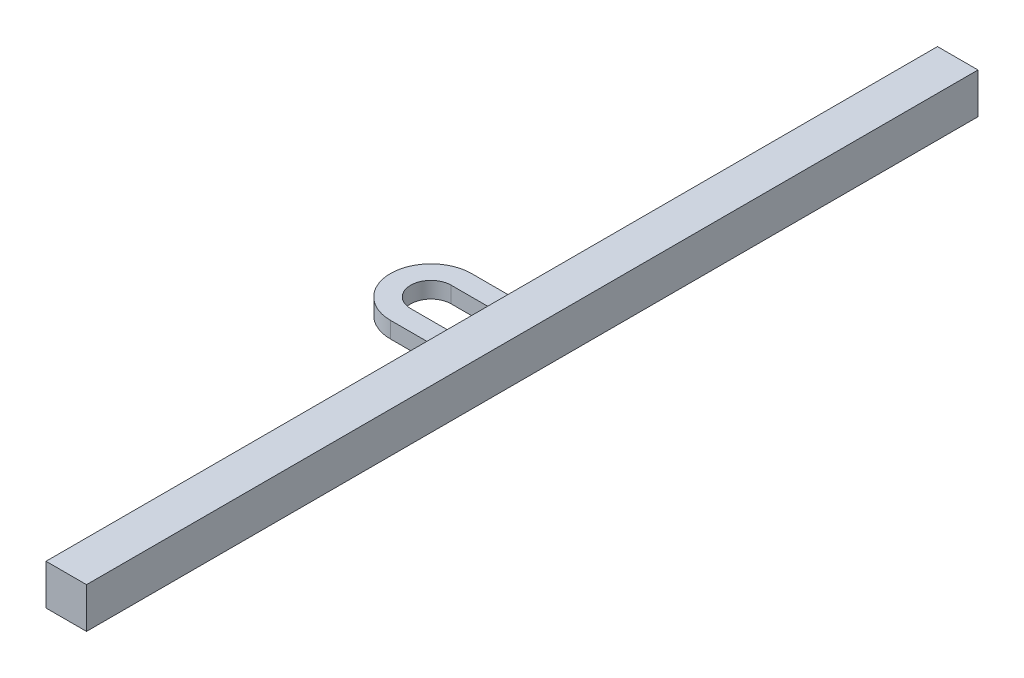
ISO-10303-21;
HEADER;
FILE_DESCRIPTION(('STEP AP214'),'2;1');
FILE_NAME('part.step','',(''),(''),'','','');
FILE_SCHEMA(('AUTOMOTIVE_DESIGN { 1 0 10303 214 1 1 1 1 }'));
ENDSEC;
DATA;
#1=APPLICATION_CONTEXT('core data for automotive mechanical design processes');
#2=APPLICATION_PROTOCOL_DEFINITION('international standard','automotive_design',2000,#1);
#3=PRODUCT_CONTEXT('',#1,'mechanical');
#4=PRODUCT('Part','Part','',(#3));
#5=PRODUCT_RELATED_PRODUCT_CATEGORY('part','',(#4));
#6=PRODUCT_DEFINITION_FORMATION('','',#4);
#7=PRODUCT_DEFINITION_CONTEXT('part definition',#1,'design');
#8=PRODUCT_DEFINITION('design','',#6,#7);
#9=PRODUCT_DEFINITION_SHAPE('','',#8);
#10=(LENGTH_UNIT() NAMED_UNIT(*) SI_UNIT(.MILLI.,.METRE.));
#11=(NAMED_UNIT(*) PLANE_ANGLE_UNIT() SI_UNIT($,.RADIAN.));
#12=(NAMED_UNIT(*) SI_UNIT($,.STERADIAN.) SOLID_ANGLE_UNIT());
#13=UNCERTAINTY_MEASURE_WITH_UNIT(LENGTH_MEASURE(1.E-05),#10,'distance_accuracy_value','');
#14=(GEOMETRIC_REPRESENTATION_CONTEXT(3) GLOBAL_UNCERTAINTY_ASSIGNED_CONTEXT((#13)) GLOBAL_UNIT_ASSIGNED_CONTEXT((#10,
#11,#12)) REPRESENTATION_CONTEXT('',''));
#15=CARTESIAN_POINT('',(0.,0.,0.));
#16=DIRECTION('',(0.,0.,1.));
#17=DIRECTION('',(1.,0.,0.));
#18=AXIS2_PLACEMENT_3D('',#15,#16,#17);
#19=CARTESIAN_POINT('',(-6.35,12.7,0.));
#20=DIRECTION('',(-1.,0.,0.));
#21=DIRECTION('',(0.,0.,1.));
#22=AXIS2_PLACEMENT_3D('',#19,#20,#21);
#23=PLANE('',#22);
#24=DIRECTION('',(0.,0.,-1.));
#25=VECTOR('',#24,1.);
#26=CARTESIAN_POINT('',(-6.35,5.08,0.));
#27=LINE('',#26,#25);
#28=CARTESIAN_POINT('',(-6.35,5.08,12.6999999999999));
#29=VERTEX_POINT('',#28);
#30=CARTESIAN_POINT('',(-6.35,5.08,6.34999999999995));
#31=VERTEX_POINT('',#30);
#32=EDGE_CURVE('E165',#29,#31,#27,.T.);
#33=ORIENTED_EDGE('',*,*,#32,.F.);
#34=DIRECTION('',(0.,-1.,0.));
#35=VECTOR('',#34,1.);
#36=CARTESIAN_POINT('',(-6.35,5.08,12.6999999999999));
#37=LINE('',#36,#35);
#38=CARTESIAN_POINT('',(-6.35,0.,12.6999999999999));
#39=VERTEX_POINT('',#38);
#40=EDGE_CURVE('E194',#29,#39,#37,.T.);
#41=ORIENTED_EDGE('',*,*,#40,.T.);
#42=DIRECTION('',(0.,0.,-1.));
#43=VECTOR('',#42,1.);
#44=CARTESIAN_POINT('',(-6.35,0.,0.));
#45=LINE('',#44,#43);
#46=CARTESIAN_POINT('',(-6.35,0.,139.7));
#47=VERTEX_POINT('',#46);
#48=EDGE_CURVE('E202',#47,#39,#45,.T.);
#49=ORIENTED_EDGE('',*,*,#48,.F.);
#50=DIRECTION('',(0.,-1.,0.));
#51=VECTOR('',#50,1.);
#52=CARTESIAN_POINT('',(-6.35,12.7,139.7));
#53=LINE('',#52,#51);
#54=CARTESIAN_POINT('',(-6.35,12.7,139.7));
#55=VERTEX_POINT('',#54);
#56=EDGE_CURVE('E210',#55,#47,#53,.T.);
#57=ORIENTED_EDGE('',*,*,#56,.F.);
#58=DIRECTION('',(0.,0.,-1.));
#59=VECTOR('',#58,1.);
#60=CARTESIAN_POINT('',(-6.35,12.7,0.));
#61=LINE('',#60,#59);
#62=CARTESIAN_POINT('',(-6.35,12.7,-139.7));
#63=VERTEX_POINT('',#62);
#64=EDGE_CURVE('E207',#55,#63,#61,.T.);
#65=ORIENTED_EDGE('',*,*,#64,.T.);
#66=DIRECTION('',(0.,-1.,0.));
#67=VECTOR('',#66,1.);
#68=CARTESIAN_POINT('',(-6.35,12.7,-139.7));
#69=LINE('',#68,#67);
#70=CARTESIAN_POINT('',(-6.35,0.,-139.7));
#71=VERTEX_POINT('',#70);
#72=EDGE_CURVE('E224',#63,#71,#69,.T.);
#73=ORIENTED_EDGE('',*,*,#72,.T.);
#74=CARTESIAN_POINT('',(-6.35,0.,-12.7000000000001));
#75=VERTEX_POINT('',#74);
#76=EDGE_CURVE('E219',#75,#71,#45,.T.);
#77=ORIENTED_EDGE('',*,*,#76,.F.);
#78=DIRECTION('',(0.,-1.,0.));
#79=VECTOR('',#78,1.);
#80=CARTESIAN_POINT('',(-6.35,5.08,-12.7000000000001));
#81=LINE('',#80,#79);
#82=CARTESIAN_POINT('',(-6.35,5.08,-12.7000000000001));
#83=VERTEX_POINT('',#82);
#84=EDGE_CURVE('E176',#83,#75,#81,.T.);
#85=ORIENTED_EDGE('',*,*,#84,.F.);
#86=DIRECTION('',(0.,0.,-1.));
#87=VECTOR('',#86,1.);
#88=CARTESIAN_POINT('',(-6.35,5.08,0.));
#89=LINE('',#88,#87);
#90=CARTESIAN_POINT('',(-6.35,5.08,-6.35000000000005));
#91=VERTEX_POINT('',#90);
#92=EDGE_CURVE('E158',#91,#83,#89,.T.);
#93=ORIENTED_EDGE('',*,*,#92,.F.);
#94=DIRECTION('',(0.,-1.,0.));
#95=VECTOR('',#94,1.);
#96=CARTESIAN_POINT('',(-6.35,5.08,-6.35000000000005));
#97=LINE('',#96,#95);
#98=CARTESIAN_POINT('',(-6.35,0.,-6.35000000000005));
#99=VERTEX_POINT('',#98);
#100=EDGE_CURVE('E185',#91,#99,#97,.T.);
#101=ORIENTED_EDGE('',*,*,#100,.T.);
#102=CARTESIAN_POINT('',(-6.35,0.,6.34999999999995));
#103=VERTEX_POINT('',#102);
#104=EDGE_CURVE('E222',#103,#99,#45,.T.);
#105=ORIENTED_EDGE('',*,*,#104,.F.);
#106=DIRECTION('',(0.,-1.,0.));
#107=VECTOR('',#106,1.);
#108=CARTESIAN_POINT('',(-6.35,5.08,6.34999999999995));
#109=LINE('',#108,#107);
#110=EDGE_CURVE('E192',#31,#103,#109,.T.);
#111=ORIENTED_EDGE('',*,*,#110,.F.);
#112=EDGE_LOOP('',(#33,#41,#49,#57,#65,#73,#77,#85,#93,#101,#105,#111));
#113=FACE_BOUND('',#112,.T.);
#114=ADVANCED_FACE('F47',(#113),#23,.T.);
#115=CARTESIAN_POINT('',(0.,12.7,139.7));
#116=DIRECTION('',(0.,0.,-1.));
#117=DIRECTION('',(-1.,0.,0.));
#118=AXIS2_PLACEMENT_3D('',#115,#116,#117);
#119=PLANE('',#118);
#120=DIRECTION('',(1.,0.,0.));
#121=VECTOR('',#120,1.);
#122=CARTESIAN_POINT('',(0.,0.,139.7));
#123=LINE('',#122,#121);
#124=CARTESIAN_POINT('',(6.35,0.,139.7));
#125=VERTEX_POINT('',#124);
#126=EDGE_CURVE('E145',#47,#125,#123,.T.);
#127=ORIENTED_EDGE('',*,*,#126,.T.);
#128=DIRECTION('',(0.,-1.,0.));
#129=VECTOR('',#128,1.);
#130=CARTESIAN_POINT('',(6.35,12.7,139.7));
#131=LINE('',#130,#129);
#132=CARTESIAN_POINT('',(6.35,12.7,139.7));
#133=VERTEX_POINT('',#132);
#134=EDGE_CURVE('E13',#133,#125,#131,.T.);
#135=ORIENTED_EDGE('',*,*,#134,.F.);
#136=DIRECTION('',(1.,0.,0.));
#137=VECTOR('',#136,1.);
#138=CARTESIAN_POINT('',(0.,12.7,139.7));
#139=LINE('',#138,#137);
#140=EDGE_CURVE('E198',#55,#133,#139,.T.);
#141=ORIENTED_EDGE('',*,*,#140,.F.);
#142=ORIENTED_EDGE('',*,*,#56,.T.);
#143=EDGE_LOOP('',(#127,#135,#141,#142));
#144=FACE_BOUND('',#143,.T.);
#145=ADVANCED_FACE('F49',(#144),#119,.F.);
#146=CARTESIAN_POINT('',(6.35,12.7,0.));
#147=DIRECTION('',(-1.,0.,0.));
#148=DIRECTION('',(0.,0.,1.));
#149=AXIS2_PLACEMENT_3D('',#146,#147,#148);
#150=PLANE('',#149);
#151=DIRECTION('',(0.,0.,-1.));
#152=VECTOR('',#151,1.);
#153=CARTESIAN_POINT('',(6.35,0.,0.));
#154=LINE('',#153,#152);
#155=CARTESIAN_POINT('',(6.35,0.,-139.7));
#156=VERTEX_POINT('',#155);
#157=EDGE_CURVE('E213',#125,#156,#154,.T.);
#158=ORIENTED_EDGE('',*,*,#157,.T.);
#159=DIRECTION('',(0.,-1.,0.));
#160=VECTOR('',#159,1.);
#161=CARTESIAN_POINT('',(6.35,12.7,-139.7));
#162=LINE('',#161,#160);
#163=CARTESIAN_POINT('',(6.35,12.7,-139.7));
#164=VERTEX_POINT('',#163);
#165=EDGE_CURVE('E55',#164,#156,#162,.T.);
#166=ORIENTED_EDGE('',*,*,#165,.F.);
#167=DIRECTION('',(0.,0.,-1.));
#168=VECTOR('',#167,1.);
#169=CARTESIAN_POINT('',(6.35,12.7,0.));
#170=LINE('',#169,#168);
#171=EDGE_CURVE('E201',#133,#164,#170,.T.);
#172=ORIENTED_EDGE('',*,*,#171,.F.);
#173=ORIENTED_EDGE('',*,*,#134,.T.);
#174=EDGE_LOOP('',(#158,#166,#172,#173));
#175=FACE_BOUND('',#174,.T.);
#176=ADVANCED_FACE('F232',(#175),#150,.F.);
#177=CARTESIAN_POINT('',(0.,12.7,-139.7));
#178=DIRECTION('',(0.,0.,-1.));
#179=DIRECTION('',(-1.,0.,0.));
#180=AXIS2_PLACEMENT_3D('',#177,#178,#179);
#181=PLANE('',#180);
#182=DIRECTION('',(1.,0.,0.));
#183=VECTOR('',#182,1.);
#184=CARTESIAN_POINT('',(0.,0.,-139.7));
#185=LINE('',#184,#183);
#186=EDGE_CURVE('E216',#71,#156,#185,.T.);
#187=ORIENTED_EDGE('',*,*,#186,.F.);
#188=ORIENTED_EDGE('',*,*,#72,.F.);
#189=DIRECTION('',(1.,0.,0.));
#190=VECTOR('',#189,1.);
#191=CARTESIAN_POINT('',(0.,12.7,-139.7));
#192=LINE('',#191,#190);
#193=EDGE_CURVE('E204',#63,#164,#192,.T.);
#194=ORIENTED_EDGE('',*,*,#193,.T.);
#195=ORIENTED_EDGE('',*,*,#165,.T.);
#196=EDGE_LOOP('',(#187,#188,#194,#195));
#197=FACE_BOUND('',#196,.T.);
#198=ADVANCED_FACE('F229',(#197),#181,.T.);
#199=CARTESIAN_POINT('',(0.,12.7,0.));
#200=DIRECTION('',(0.,1.,0.));
#201=DIRECTION('',(0.,0.,1.));
#202=AXIS2_PLACEMENT_3D('',#199,#200,#201);
#203=PLANE('',#202);
#204=ORIENTED_EDGE('',*,*,#140,.T.);
#205=ORIENTED_EDGE('',*,*,#171,.T.);
#206=ORIENTED_EDGE('',*,*,#193,.F.);
#207=ORIENTED_EDGE('',*,*,#64,.F.);
#208=EDGE_LOOP('',(#204,#205,#206,#207));
#209=FACE_BOUND('',#208,.T.);
#210=ADVANCED_FACE('F241',(#209),#203,.T.);
#211=CARTESIAN_POINT('',(0.,0.,0.));
#212=DIRECTION('',(0.,1.,0.));
#213=DIRECTION('',(0.,0.,1.));
#214=AXIS2_PLACEMENT_3D('',#211,#212,#213);
#215=PLANE('',#214);
#216=DIRECTION('',(1.,0.,0.));
#217=VECTOR('',#216,1.);
#218=CARTESIAN_POINT('',(0.,0.,6.34999999999999));
#219=LINE('',#218,#217);
#220=CARTESIAN_POINT('',(-25.4,0.,6.34999999999992));
#221=VERTEX_POINT('',#220);
#222=EDGE_CURVE('E70',#221,#103,#219,.T.);
#223=ORIENTED_EDGE('',*,*,#222,.T.);
#224=ORIENTED_EDGE('',*,*,#104,.T.);
#225=DIRECTION('',(1.,0.,0.));
#226=VECTOR('',#225,1.);
#227=CARTESIAN_POINT('',(0.,0.,-6.35000000000001));
#228=LINE('',#227,#226);
#229=CARTESIAN_POINT('',(-25.4,0.,-6.35000000000008));
#230=VERTEX_POINT('',#229);
#231=EDGE_CURVE('E159',#230,#99,#228,.T.);
#232=ORIENTED_EDGE('',*,*,#231,.F.);
#233=CARTESIAN_POINT('',(-25.4,0.,0.));
#234=DIRECTION('',(0.,1.,0.));
#235=DIRECTION('',(0.,0.,1.));
#236=AXIS2_PLACEMENT_3D('',#233,#234,#235);
#237=CIRCLE('',#236,6.35);
#238=EDGE_CURVE('E161',#230,#221,#237,.T.);
#239=ORIENTED_EDGE('',*,*,#238,.T.);
#240=EDGE_LOOP('',(#223,#224,#232,#239));
#241=FACE_BOUND('',#240,.T.);
#242=ORIENTED_EDGE('',*,*,#126,.F.);
#243=ORIENTED_EDGE('',*,*,#48,.T.);
#244=DIRECTION('',(1.,0.,0.));
#245=VECTOR('',#244,1.);
#246=CARTESIAN_POINT('',(0.,0.,12.6999999999999));
#247=LINE('',#246,#245);
#248=CARTESIAN_POINT('',(-25.4,0.,12.6999999999999));
#249=VERTEX_POINT('',#248);
#250=EDGE_CURVE('E180',#249,#39,#247,.T.);
#251=ORIENTED_EDGE('',*,*,#250,.F.);
#252=CARTESIAN_POINT('',(-25.4,0.,0.));
#253=DIRECTION('',(0.,1.,0.));
#254=DIRECTION('',(0.,0.,1.));
#255=AXIS2_PLACEMENT_3D('',#252,#253,#254);
#256=CIRCLE('',#255,12.7);
#257=CARTESIAN_POINT('',(-25.4,0.,-12.7000000000001));
#258=VERTEX_POINT('',#257);
#259=EDGE_CURVE('E178',#258,#249,#256,.T.);
#260=ORIENTED_EDGE('',*,*,#259,.F.);
#261=DIRECTION('',(1.,0.,0.));
#262=VECTOR('',#261,1.);
#263=CARTESIAN_POINT('',(0.,0.,-12.7000000000001));
#264=LINE('',#263,#262);
#265=EDGE_CURVE('E62',#258,#75,#264,.T.);
#266=ORIENTED_EDGE('',*,*,#265,.T.);
#267=ORIENTED_EDGE('',*,*,#76,.T.);
#268=ORIENTED_EDGE('',*,*,#186,.T.);
#269=ORIENTED_EDGE('',*,*,#157,.F.);
#270=EDGE_LOOP('',(#242,#243,#251,#260,#266,#267,#268,#269));
#271=FACE_BOUND('',#270,.T.);
#272=ADVANCED_FACE('F235',(#241,#271),#215,.F.);
#273=CARTESIAN_POINT('',(0.,5.08,-12.7000000000001));
#274=DIRECTION('',(0.,0.,-1.));
#275=DIRECTION('',(-1.,0.,0.));
#276=AXIS2_PLACEMENT_3D('',#273,#274,#275);
#277=PLANE('',#276);
#278=ORIENTED_EDGE('',*,*,#265,.F.);
#279=DIRECTION('',(0.,-1.,0.));
#280=VECTOR('',#279,1.);
#281=CARTESIAN_POINT('',(-25.4,5.08,-12.7000000000001));
#282=LINE('',#281,#280);
#283=CARTESIAN_POINT('',(-25.4,5.08,-12.7000000000001));
#284=VERTEX_POINT('',#283);
#285=EDGE_CURVE('E138',#284,#258,#282,.T.);
#286=ORIENTED_EDGE('',*,*,#285,.F.);
#287=DIRECTION('',(1.,0.,0.));
#288=VECTOR('',#287,1.);
#289=CARTESIAN_POINT('',(0.,5.08,-12.7000000000001));
#290=LINE('',#289,#288);
#291=EDGE_CURVE('E142',#284,#83,#290,.T.);
#292=ORIENTED_EDGE('',*,*,#291,.T.);
#293=ORIENTED_EDGE('',*,*,#84,.T.);
#294=EDGE_LOOP('',(#278,#286,#292,#293));
#295=FACE_BOUND('',#294,.T.);
#296=ADVANCED_FACE('F140',(#295),#277,.T.);
#297=CARTESIAN_POINT('',(-25.4,5.08,0.));
#298=DIRECTION('',(0.,-1.,0.));
#299=DIRECTION('',(0.,0.,-1.));
#300=AXIS2_PLACEMENT_3D('',#297,#298,#299);
#301=CYLINDRICAL_SURFACE('',#300,12.7);
#302=ORIENTED_EDGE('',*,*,#259,.T.);
#303=DIRECTION('',(0.,-1.,0.));
#304=VECTOR('',#303,1.);
#305=CARTESIAN_POINT('',(-25.4,5.08,12.6999999999999));
#306=LINE('',#305,#304);
#307=CARTESIAN_POINT('',(-25.4,5.08,12.6999999999999));
#308=VERTEX_POINT('',#307);
#309=EDGE_CURVE('E146',#308,#249,#306,.T.);
#310=ORIENTED_EDGE('',*,*,#309,.F.);
#311=CARTESIAN_POINT('',(-25.4,5.08,0.));
#312=DIRECTION('',(0.,1.,0.));
#313=DIRECTION('',(0.,0.,1.));
#314=AXIS2_PLACEMENT_3D('',#311,#312,#313);
#315=CIRCLE('',#314,12.7);
#316=EDGE_CURVE('E149',#284,#308,#315,.T.);
#317=ORIENTED_EDGE('',*,*,#316,.F.);
#318=ORIENTED_EDGE('',*,*,#285,.T.);
#319=EDGE_LOOP('',(#302,#310,#317,#318));
#320=FACE_BOUND('',#319,.T.);
#321=ADVANCED_FACE('F150',(#320),#301,.T.);
#322=CARTESIAN_POINT('',(0.,5.08,12.6999999999999));
#323=DIRECTION('',(0.,0.,-1.));
#324=DIRECTION('',(-1.,0.,0.));
#325=AXIS2_PLACEMENT_3D('',#322,#323,#324);
#326=PLANE('',#325);
#327=ORIENTED_EDGE('',*,*,#250,.T.);
#328=ORIENTED_EDGE('',*,*,#40,.F.);
#329=DIRECTION('',(1.,0.,0.));
#330=VECTOR('',#329,1.);
#331=CARTESIAN_POINT('',(0.,5.08,12.6999999999999));
#332=LINE('',#331,#330);
#333=EDGE_CURVE('E154',#308,#29,#332,.T.);
#334=ORIENTED_EDGE('',*,*,#333,.F.);
#335=ORIENTED_EDGE('',*,*,#309,.T.);
#336=EDGE_LOOP('',(#327,#328,#334,#335));
#337=FACE_BOUND('',#336,.T.);
#338=ADVANCED_FACE('F249',(#337),#326,.F.);
#339=CARTESIAN_POINT('',(0.,5.08,6.34999999999999));
#340=DIRECTION('',(0.,0.,-1.));
#341=DIRECTION('',(-1.,0.,0.));
#342=AXIS2_PLACEMENT_3D('',#339,#340,#341);
#343=PLANE('',#342);
#344=ORIENTED_EDGE('',*,*,#222,.F.);
#345=DIRECTION('',(0.,-1.,0.));
#346=VECTOR('',#345,1.);
#347=CARTESIAN_POINT('',(-25.4,5.08,6.34999999999992));
#348=LINE('',#347,#346);
#349=CARTESIAN_POINT('',(-25.4,5.08,6.34999999999992));
#350=VERTEX_POINT('',#349);
#351=EDGE_CURVE('E190',#350,#221,#348,.T.);
#352=ORIENTED_EDGE('',*,*,#351,.F.);
#353=DIRECTION('',(1.,0.,0.));
#354=VECTOR('',#353,1.);
#355=CARTESIAN_POINT('',(0.,5.08,6.34999999999999));
#356=LINE('',#355,#354);
#357=EDGE_CURVE('E167',#350,#31,#356,.T.);
#358=ORIENTED_EDGE('',*,*,#357,.T.);
#359=ORIENTED_EDGE('',*,*,#110,.T.);
#360=EDGE_LOOP('',(#344,#352,#358,#359));
#361=FACE_BOUND('',#360,.T.);
#362=ADVANCED_FACE('F253',(#361),#343,.T.);
#363=CARTESIAN_POINT('',(-25.4,5.08,0.));
#364=DIRECTION('',(0.,-1.,0.));
#365=DIRECTION('',(0.,0.,-1.));
#366=AXIS2_PLACEMENT_3D('',#363,#364,#365);
#367=CYLINDRICAL_SURFACE('',#366,6.35);
#368=ORIENTED_EDGE('',*,*,#238,.F.);
#369=DIRECTION('',(0.,-1.,0.));
#370=VECTOR('',#369,1.);
#371=CARTESIAN_POINT('',(-25.4,5.08,-6.35000000000008));
#372=LINE('',#371,#370);
#373=CARTESIAN_POINT('',(-25.4,5.08,-6.35000000000008));
#374=VERTEX_POINT('',#373);
#375=EDGE_CURVE('E188',#374,#230,#372,.T.);
#376=ORIENTED_EDGE('',*,*,#375,.F.);
#377=CARTESIAN_POINT('',(-25.4,5.08,0.));
#378=DIRECTION('',(0.,1.,0.));
#379=DIRECTION('',(0.,0.,1.));
#380=AXIS2_PLACEMENT_3D('',#377,#378,#379);
#381=CIRCLE('',#380,6.35);
#382=EDGE_CURVE('E170',#374,#350,#381,.T.);
#383=ORIENTED_EDGE('',*,*,#382,.T.);
#384=ORIENTED_EDGE('',*,*,#351,.T.);
#385=EDGE_LOOP('',(#368,#376,#383,#384));
#386=FACE_BOUND('',#385,.T.);
#387=ADVANCED_FACE('F260',(#386),#367,.F.);
#388=CARTESIAN_POINT('',(0.,5.08,-6.35000000000001));
#389=DIRECTION('',(0.,0.,-1.));
#390=DIRECTION('',(-1.,0.,0.));
#391=AXIS2_PLACEMENT_3D('',#388,#389,#390);
#392=PLANE('',#391);
#393=ORIENTED_EDGE('',*,*,#231,.T.);
#394=ORIENTED_EDGE('',*,*,#100,.F.);
#395=DIRECTION('',(1.,0.,0.));
#396=VECTOR('',#395,1.);
#397=CARTESIAN_POINT('',(0.,5.08,-6.35000000000001));
#398=LINE('',#397,#396);
#399=EDGE_CURVE('E173',#374,#91,#398,.T.);
#400=ORIENTED_EDGE('',*,*,#399,.F.);
#401=ORIENTED_EDGE('',*,*,#375,.T.);
#402=EDGE_LOOP('',(#393,#394,#400,#401));
#403=FACE_BOUND('',#402,.T.);
#404=ADVANCED_FACE('F262',(#403),#392,.F.);
#405=CARTESIAN_POINT('',(0.,5.08,0.));
#406=DIRECTION('',(0.,1.,0.));
#407=DIRECTION('',(0.,0.,1.));
#408=AXIS2_PLACEMENT_3D('',#405,#406,#407);
#409=PLANE('',#408);
#410=ORIENTED_EDGE('',*,*,#291,.F.);
#411=ORIENTED_EDGE('',*,*,#316,.T.);
#412=ORIENTED_EDGE('',*,*,#333,.T.);
#413=ORIENTED_EDGE('',*,*,#32,.T.);
#414=ORIENTED_EDGE('',*,*,#357,.F.);
#415=ORIENTED_EDGE('',*,*,#382,.F.);
#416=ORIENTED_EDGE('',*,*,#399,.T.);
#417=ORIENTED_EDGE('',*,*,#92,.T.);
#418=EDGE_LOOP('',(#410,#411,#412,#413,#414,#415,#416,#417));
#419=FACE_BOUND('',#418,.T.);
#420=ADVANCED_FACE('F156',(#419),#409,.T.);
#421=CLOSED_SHELL('',(#114,#145,#176,#198,#210,#272,#296,#321,#338,#362,#387,#404,#420));
#422=MANIFOLD_SOLID_BREP('B2',#421);
#423=ADVANCED_BREP_SHAPE_REPRESENTATION('',(#18,#422),#14);
#424=SHAPE_DEFINITION_REPRESENTATION(#9,#423);
ENDSEC;
END-ISO-10303-21;
